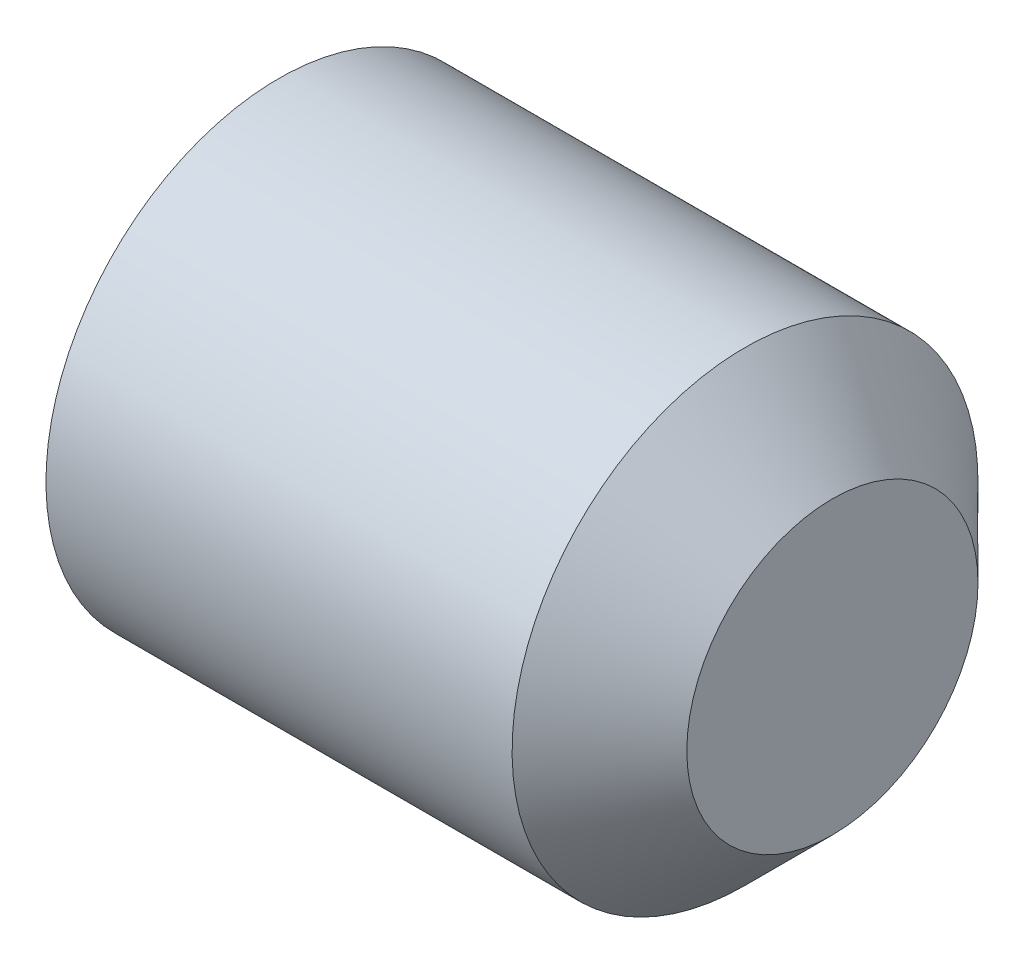
ISO-10303-21;
HEADER;
FILE_DESCRIPTION(('STEP AP214'),'2;1');
FILE_NAME('part.step','',(''),(''),'','','');
FILE_SCHEMA(('AUTOMOTIVE_DESIGN { 1 0 10303 214 1 1 1 1 }'));
ENDSEC;
DATA;
#1=APPLICATION_CONTEXT('core data for automotive mechanical design processes');
#2=APPLICATION_PROTOCOL_DEFINITION('international standard','automotive_design',2000,#1);
#3=PRODUCT_CONTEXT('',#1,'mechanical');
#4=PRODUCT('Part','Part','',(#3));
#5=PRODUCT_RELATED_PRODUCT_CATEGORY('part','',(#4));
#6=PRODUCT_DEFINITION_FORMATION('','',#4);
#7=PRODUCT_DEFINITION_CONTEXT('part definition',#1,'design');
#8=PRODUCT_DEFINITION('design','',#6,#7);
#9=PRODUCT_DEFINITION_SHAPE('','',#8);
#10=(LENGTH_UNIT() NAMED_UNIT(*) SI_UNIT(.MILLI.,.METRE.));
#11=(NAMED_UNIT(*) PLANE_ANGLE_UNIT() SI_UNIT($,.RADIAN.));
#12=(NAMED_UNIT(*) SI_UNIT($,.STERADIAN.) SOLID_ANGLE_UNIT());
#13=UNCERTAINTY_MEASURE_WITH_UNIT(LENGTH_MEASURE(1.E-05),#10,'distance_accuracy_value','');
#14=(GEOMETRIC_REPRESENTATION_CONTEXT(3) GLOBAL_UNCERTAINTY_ASSIGNED_CONTEXT((#13)) GLOBAL_UNIT_ASSIGNED_CONTEXT((#10,
#11,#12)) REPRESENTATION_CONTEXT('',''));
#15=CARTESIAN_POINT('',(0.,0.,0.));
#16=DIRECTION('',(0.,0.,1.));
#17=DIRECTION('',(1.,0.,0.));
#18=AXIS2_PLACEMENT_3D('',#15,#16,#17);
#19=CARTESIAN_POINT('',(0.66666666666667,0.,0.));
#20=DIRECTION('',(-1.,0.,0.));
#21=DIRECTION('',(0.,-1.,0.));
#22=AXIS2_PLACEMENT_3D('',#19,#20,#21);
#23=CONICAL_SURFACE('',#22,0.,1.04719755119661);
#24=CARTESIAN_POINT('',(0.,0.,0.));
#25=DIRECTION('',(-1.,0.,0.));
#26=DIRECTION('',(0.,-1.,0.));
#27=AXIS2_PLACEMENT_3D('',#24,#25,#26);
#28=CIRCLE('',#27,1.1547005383793);
#29=CARTESIAN_POINT('',(0.,0.,1.1547005383793));
#30=VERTEX_POINT('',#29);
#31=CARTESIAN_POINT('',(0.,1.00000000000008,0.577350269189584));
#32=VERTEX_POINT('',#31);
#33=EDGE_CURVE('E133',#30,#32,#28,.T.);
#34=ORIENTED_EDGE('',*,*,#33,.T.);
#35=CARTESIAN_POINT('',(-6.66766656399665E-05,1.0002,0.577234799135792));
#36=CARTESIAN_POINT('',(0.0145910263508786,0.956252680601721,0.602607795820553));
#37=CARTESIAN_POINT('',(0.0279222763791293,0.911926016050181,0.628199807531665));
#38=CARTESIAN_POINT('',(0.0511934923765663,0.822504925328881,0.679827098330841));
#39=CARTESIAN_POINT('',(0.061125223450238,0.777408908798272,0.70586329561417));
#40=CARTESIAN_POINT('',(0.0765873051179378,0.687775829477386,0.757612978088382));
#41=CARTESIAN_POINT('',(0.082220531901062,0.643252567766787,0.783318495222199));
#42=CARTESIAN_POINT('',(0.0889487113597592,0.55399626028499,0.83485064837369));
#43=CARTESIAN_POINT('',(0.0900492320783483,0.509263539518514,0.860677096749802));
#44=CARTESIAN_POINT('',(0.0877749477018723,0.425658889182662,0.908946264126714));
#45=CARTESIAN_POINT('',(0.0849585611365997,0.386774523211241,0.931396163287583));
#46=CARTESIAN_POINT('',(0.0760275497826569,0.30925915501482,0.976149681982124));
#47=CARTESIAN_POINT('',(0.0699098662457069,0.270628421438366,0.998453146411484));
#48=CARTESIAN_POINT('',(0.0546142742741818,0.192952883515859,1.0432991391405));
#49=CARTESIAN_POINT('',(0.0453714478310436,0.153917923728835,1.06583598368134));
#50=CARTESIAN_POINT('',(0.0243931542444719,0.0764306187239893,1.11057330008467));
#51=CARTESIAN_POINT('',(0.012662624866338,0.0379772787061415,1.13277434629522));
#52=CARTESIAN_POINT('',(-6.66766656664409E-05,-0.000200000000000106,1.15481600843314));
#53=B_SPLINE_CURVE_WITH_KNOTS('',3,(#35,#36,#37,#38,#39,#40,#41,#42,#43,#44,#45,#46,#47,#48,#49,
#50,#51,#52),.UNSPECIFIED.,.F.,.F.,(4,2,2,2,2,2,2,2,4),(0.,0.158523820030115,0.317428970089341,
0.472400167924632,0.627180939971646,0.762016584872715,0.896977373984242,1.03493410168669,
1.17261952416174),.UNSPECIFIED.);
#54=EDGE_CURVE('E11',#32,#30,#53,.T.);
#55=ORIENTED_EDGE('',*,*,#54,.T.);
#56=EDGE_LOOP('',(#34,#55));
#57=FACE_BOUND('',#56,.T.);
#58=ADVANCED_FACE('F31',(#57),#23,.F.);
#59=CARTESIAN_POINT('',(0.,-1.,0.57735026918963));
#60=VERTEX_POINT('',#59);
#61=EDGE_CURVE('E129',#60,#30,#28,.T.);
#62=ORIENTED_EDGE('',*,*,#61,.T.);
#63=CARTESIAN_POINT('',(-6.66766656665343E-05,0.000199999999999947,1.15481600843314));
#64=CARTESIAN_POINT('',(0.0145910263508541,-0.0437473193982807,1.12944301174838));
#65=CARTESIAN_POINT('',(0.027922276379107,-0.0880739839498216,1.10385100003726));
#66=CARTESIAN_POINT('',(0.0511934923765487,-0.177495074671124,1.05222370923809));
#67=CARTESIAN_POINT('',(0.0611252234502229,-0.222591091201734,1.02618751195476));
#68=CARTESIAN_POINT('',(0.0765873051179279,-0.312224170522623,0.974437829480542));
#69=CARTESIAN_POINT('',(0.0822205319010547,-0.356747432233225,0.948732312346724));
#70=CARTESIAN_POINT('',(0.0889487113597568,-0.446003739715024,0.897200159195231));
#71=CARTESIAN_POINT('',(0.0900492320783479,-0.490736460481502,0.871373710819119));
#72=CARTESIAN_POINT('',(0.0877749477018759,-0.574341110817354,0.823104543442207));
#73=CARTESIAN_POINT('',(0.0849585611366055,-0.613225476788773,0.800654644281338));
#74=CARTESIAN_POINT('',(0.0760275497826668,-0.690740844985192,0.755901125586799));
#75=CARTESIAN_POINT('',(0.0699098662457189,-0.729371578561644,0.73359766115744));
#76=CARTESIAN_POINT('',(0.054614274274198,-0.807047116484149,0.68875166842843));
#77=CARTESIAN_POINT('',(0.045371447831062,-0.84608207627117,0.666214823887585));
#78=CARTESIAN_POINT('',(0.0243931542444946,-0.923569381276013,0.621477507484257));
#79=CARTESIAN_POINT('',(0.0126626248663627,-0.96202272129386,0.599276461273711));
#80=CARTESIAN_POINT('',(-6.66766656397759E-05,-1.0002,0.577234799135792));
#81=B_SPLINE_CURVE_WITH_KNOTS('',3,(#63,#64,#65,#66,#67,#68,#69,#70,#71,#72,#73,#74,#75,#76,#77,
#78,#79,#80),.UNSPECIFIED.,.F.,.F.,(4,2,2,2,2,2,2,2,4),(0.,0.158523820030121,0.317428970089354,
0.47240016792465,0.627180939971671,0.762016584872733,0.896977373984255,1.03493410168669,
1.17261952416174),.UNSPECIFIED.);
#82=EDGE_CURVE('E44',#30,#60,#81,.T.);
#83=ORIENTED_EDGE('',*,*,#82,.T.);
#84=EDGE_LOOP('',(#62,#83));
#85=FACE_BOUND('',#84,.T.);
#86=ADVANCED_FACE('F199',(#85),#23,.F.);
#87=CARTESIAN_POINT('',(0.,-1.,-0.57735026918963));
#88=VERTEX_POINT('',#87);
#89=EDGE_CURVE('E128',#88,#60,#28,.T.);
#90=ORIENTED_EDGE('',*,*,#89,.T.);
#91=CARTESIAN_POINT('',(-0.371835288739451,-1.,-1.49514512143379));
#92=CARTESIAN_POINT('',(-0.351115020793417,-1.,-1.45196126115335));
#93=CARTESIAN_POINT('',(-0.330613672349449,-1.,-1.40867282404241));
#94=CARTESIAN_POINT('',(-0.290163433524583,-1.,-1.32182947914252));
#95=CARTESIAN_POINT('',(-0.270214642567272,-1.,-1.2782745250976));
#96=CARTESIAN_POINT('',(-0.211145154836465,-1.,-1.14662339890629));
#97=CARTESIAN_POINT('',(-0.173052526533021,-1.,-1.05805724149112));
#98=CARTESIAN_POINT('',(-0.100245820700553,-1.,-0.876833003172523));
#99=CARTESIAN_POINT('',(-0.0656458404538963,-1.,-0.784128452056518));
#100=CARTESIAN_POINT('',(-0.00407347381842811,-1.,-0.596331746532146));
#101=CARTESIAN_POINT('',(0.0229187151521698,-1.,-0.501246505541269));
#102=CARTESIAN_POINT('',(0.0542242299650066,-1.,-0.356699986452712));
#103=CARTESIAN_POINT('',(0.0631249014530373,-1.,-0.308244163171718));
#104=CARTESIAN_POINT('',(0.0772575682431124,-1.,-0.210788870695452));
#105=CARTESIAN_POINT('',(0.0824898114648446,-1.,-0.161789438465751));
#106=CARTESIAN_POINT('',(0.0888010190182573,-1.,-0.0641060489970755));
#107=CARTESIAN_POINT('',(0.0899289949889198,-1.,-0.0154253461269865));
#108=CARTESIAN_POINT('',(0.0880670216948876,-1.,0.0818553564032658));
#109=CARTESIAN_POINT('',(0.0850768174464161,-1.,0.130455350879693));
#110=CARTESIAN_POINT('',(0.0728816782707232,-1.,0.250369589613771));
#111=CARTESIAN_POINT('',(0.0613914390151371,-1.,0.321451919115022));
#112=CARTESIAN_POINT('',(0.0317596826023959,-1.,0.462229038490167));
#113=CARTESIAN_POINT('',(0.0136101490551007,-1.,0.531922048861734));
#114=CARTESIAN_POINT('',(-0.0278697226866181,-1.,0.671415729806811));
#115=CARTESIAN_POINT('',(-0.051307168306903,-1.,0.741183729418078));
#116=CARTESIAN_POINT('',(-0.101564488246382,-1.,0.8794383193963));
#117=CARTESIAN_POINT('',(-0.12838317523044,-1.,0.947925349932574));
#118=CARTESIAN_POINT('',(-0.200053915473368,-1.,1.12214515906646));
#119=CARTESIAN_POINT('',(-0.246572305198955,-1.,1.2271857404068));
#120=CARTESIAN_POINT('',(-0.342876922247949,-1.,1.4357596810456));
#121=CARTESIAN_POINT('',(-0.392663987822206,-1.,1.5392926453335));
#122=CARTESIAN_POINT('',(-0.494336444534604,-1.,1.74546702338824));
#123=CARTESIAN_POINT('',(-0.546224181866939,-1.,1.84810727554001));
#124=CARTESIAN_POINT('',(-0.651338368835187,-1.,2.05270058021729));
#125=CARTESIAN_POINT('',(-0.704564862672294,-1.,2.15465360991175));
#126=CARTESIAN_POINT('',(-0.806866916911162,-1.,2.34846553091286));
#127=CARTESIAN_POINT('',(-0.855859658963996,-1.,2.44036823161574));
#128=CARTESIAN_POINT('',(-0.954403132828168,-1.,2.62387799005304));
#129=CARTESIAN_POINT('',(-1.00395388528944,-1.,2.7154850366839));
#130=CARTESIAN_POINT('',(-1.10334710767978,-1.,2.89823865557597));
#131=CARTESIAN_POINT('',(-1.15318851504097,-1.,2.98938580641159));
#132=CARTESIAN_POINT('',(-1.25319572337608,-1.,3.17149583112626));
#133=CARTESIAN_POINT('',(-1.3033615072371,-1.,3.26245871439939));
#134=CARTESIAN_POINT('',(-1.35364621220491,-1.,3.3533553920818));
#135=B_SPLINE_CURVE_WITH_KNOTS('',3,(#91,#92,#93,#94,#95,#96,#97,#98,#99,#100,#101,#102,#103,
#104,#105,#106,#107,#108,#109,#110,#111,#112,#113,#114,#115,#116,#117,#118,#119,#120,#121,#122,
#123,#124,#125,#126,#127,#128,#129,#130,#131,#132,#133,#134),.UNSPECIFIED.,.F.,.F.,(4,2,2,2,2,2,
2,2,2,2,2,2,2,2,2,2,2,2,2,2,2,4),(0.,0.143690341820654,0.287406372566282,0.576560332877511,
0.873259488934062,1.1691790700001,1.31686338831961,1.46453772487646,1.61044269221663,
1.75635669390456,1.97192533331902,2.18775432802318,2.40842600301171,2.62902040304942,
2.97355048126465,3.3181692618629,3.66318417395138,4.00821049225249,4.32064609598604,
4.63309330006995,4.94474578248769,5.25638195528649),.UNSPECIFIED.);
#136=EDGE_CURVE('E175',#60,#88,#135,.F.);
#137=ORIENTED_EDGE('',*,*,#136,.T.);
#138=EDGE_LOOP('',(#90,#137));
#139=FACE_BOUND('',#138,.T.);
#140=ADVANCED_FACE('F205',(#139),#23,.F.);
#141=CARTESIAN_POINT('',(0.,0.,-1.1547005383793));
#142=VERTEX_POINT('',#141);
#143=EDGE_CURVE('E227',#142,#88,#28,.T.);
#144=ORIENTED_EDGE('',*,*,#143,.T.);
#145=CARTESIAN_POINT('',(-6.66766656396785E-05,-1.0002,-0.577234799135792));
#146=CARTESIAN_POINT('',(0.0145910263508786,-0.956252680601721,-0.602607795820553));
#147=CARTESIAN_POINT('',(0.0279222763791292,-0.911926016050181,-0.628199807531665));
#148=CARTESIAN_POINT('',(0.0511934923765662,-0.822504925328881,-0.679827098330841));
#149=CARTESIAN_POINT('',(0.061125223450238,-0.777408908798272,-0.70586329561417));
#150=CARTESIAN_POINT('',(0.076587305117938,-0.687775829477386,-0.757612978088382));
#151=CARTESIAN_POINT('',(0.0822205319010621,-0.643252567766786,-0.783318495222199));
#152=CARTESIAN_POINT('',(0.0889487113597592,-0.55399626028499,-0.83485064837369));
#153=CARTESIAN_POINT('',(0.0900492320783481,-0.509263539518514,-0.860677096749802));
#154=CARTESIAN_POINT('',(0.0877749477018722,-0.425658889182662,-0.908946264126714));
#155=CARTESIAN_POINT('',(0.0849585611365999,-0.386774523211241,-0.931396163287584));
#156=CARTESIAN_POINT('',(0.0760275497826571,-0.30925915501482,-0.976149681982124));
#157=CARTESIAN_POINT('',(0.0699098662457069,-0.270628421438366,-0.998453146411484));
#158=CARTESIAN_POINT('',(0.0546142742741816,-0.192952883515859,-1.0432991391405));
#159=CARTESIAN_POINT('',(0.0453714478310435,-0.153917923728835,-1.06583598368134));
#160=CARTESIAN_POINT('',(0.0243931542444719,-0.0764306187239892,-1.11057330008467));
#161=CARTESIAN_POINT('',(0.0126626248663381,-0.0379772787061413,-1.13277434629522));
#162=CARTESIAN_POINT('',(-6.66766656664812E-05,0.000200000000000098,-1.15481600843314));
#163=B_SPLINE_CURVE_WITH_KNOTS('',3,(#145,#146,#147,#148,#149,#150,#151,#152,#153,#154,#155,
#156,#157,#158,#159,#160,#161,#162),.UNSPECIFIED.,.F.,.F.,(4,2,2,2,2,2,2,2,4),(0.,
0.158523820030115,0.317428970089342,0.472400167924632,0.627180939971647,0.762016584872715,
0.896977373984243,1.03493410168669,1.17261952416174),.UNSPECIFIED.);
#164=EDGE_CURVE('E170',#88,#142,#163,.T.);
#165=ORIENTED_EDGE('',*,*,#164,.T.);
#166=EDGE_LOOP('',(#144,#165));
#167=FACE_BOUND('',#166,.T.);
#168=ADVANCED_FACE('F217',(#167),#23,.F.);
#169=CARTESIAN_POINT('',(0.,1.,-0.57735026918963));
#170=VERTEX_POINT('',#169);
#171=EDGE_CURVE('E225',#170,#142,#28,.T.);
#172=ORIENTED_EDGE('',*,*,#171,.T.);
#173=CARTESIAN_POINT('',(-6.66766656665343E-05,-0.000199999999999947,-1.15481600843314));
#174=CARTESIAN_POINT('',(0.0145910263508542,0.0437473193982806,-1.12944301174838));
#175=CARTESIAN_POINT('',(0.0279222763791071,0.0880739839498216,-1.10385100003726));
#176=CARTESIAN_POINT('',(0.0511934923765488,0.177495074671125,-1.05222370923809));
#177=CARTESIAN_POINT('',(0.061125223450223,0.222591091201735,-1.02618751195476));
#178=CARTESIAN_POINT('',(0.0765873051179279,0.312224170522623,-0.974437829480542));
#179=CARTESIAN_POINT('',(0.0822205319010546,0.356747432233225,-0.948732312346724));
#180=CARTESIAN_POINT('',(0.0889487113597566,0.446003739715024,-0.897200159195231));
#181=CARTESIAN_POINT('',(0.0900492320783478,0.490736460481502,-0.871373710819119));
#182=CARTESIAN_POINT('',(0.0877749477018758,0.574341110817354,-0.823104543442207));
#183=CARTESIAN_POINT('',(0.0849585611366055,0.613225476788773,-0.800654644281338));
#184=CARTESIAN_POINT('',(0.0760275497826669,0.690740844985192,-0.755901125586799));
#185=CARTESIAN_POINT('',(0.0699098662457189,0.729371578561644,-0.73359766115744));
#186=CARTESIAN_POINT('',(0.054614274274198,0.807047116484148,-0.68875166842843));
#187=CARTESIAN_POINT('',(0.0453714478310621,0.84608207627117,-0.666214823887585));
#188=CARTESIAN_POINT('',(0.0243931542444946,0.923569381276013,-0.621477507484257));
#189=CARTESIAN_POINT('',(0.0126626248663627,0.96202272129386,-0.599276461273711));
#190=CARTESIAN_POINT('',(-6.66766656400063E-05,1.0002,-0.577234799135792));
#191=B_SPLINE_CURVE_WITH_KNOTS('',3,(#173,#174,#175,#176,#177,#178,#179,#180,#181,#182,#183,
#184,#185,#186,#187,#188,#189,#190),.UNSPECIFIED.,.F.,.F.,(4,2,2,2,2,2,2,2,4),(0.,
0.158523820030121,0.317428970089354,0.472400167924651,0.627180939971671,0.762016584872733,
0.896977373984255,1.03493410168669,1.17261952416174),.UNSPECIFIED.);
#192=EDGE_CURVE('E111',#142,#170,#191,.T.);
#193=ORIENTED_EDGE('',*,*,#192,.T.);
#194=EDGE_LOOP('',(#172,#193));
#195=FACE_BOUND('',#194,.T.);
#196=ADVANCED_FACE('F209',(#195),#23,.F.);
#197=EDGE_CURVE('E221',#32,#170,#28,.T.);
#198=ORIENTED_EDGE('',*,*,#197,.T.);
#199=CARTESIAN_POINT('',(-0.371835288739452,1.,-1.49514512143379));
#200=CARTESIAN_POINT('',(-0.351115020793417,1.,-1.45196126115335));
#201=CARTESIAN_POINT('',(-0.33061367234945,1.,-1.40867282404241));
#202=CARTESIAN_POINT('',(-0.290163433524583,1.,-1.32182947914252));
#203=CARTESIAN_POINT('',(-0.270214642567272,1.,-1.2782745250976));
#204=CARTESIAN_POINT('',(-0.211145154836466,1.,-1.14662339890629));
#205=CARTESIAN_POINT('',(-0.173052526533021,1.,-1.05805724149112));
#206=CARTESIAN_POINT('',(-0.100245820700553,1.,-0.876833003172523));
#207=CARTESIAN_POINT('',(-0.0656458404538965,1.,-0.784128452056518));
#208=CARTESIAN_POINT('',(-0.00407347381842816,1.,-0.596331746532146));
#209=CARTESIAN_POINT('',(0.0229187151521698,1.,-0.501246505541268));
#210=CARTESIAN_POINT('',(0.0542242299650066,1.,-0.356699986452711));
#211=CARTESIAN_POINT('',(0.0631249014530372,1.,-0.308244163171718));
#212=CARTESIAN_POINT('',(0.0772575682431122,1.,-0.210788870695451));
#213=CARTESIAN_POINT('',(0.0824898114648444,1.,-0.161789438465751));
#214=CARTESIAN_POINT('',(0.0888010190182571,1.,-0.0641060489970751));
#215=CARTESIAN_POINT('',(0.0899289949889195,1.,-0.0154253461269861));
#216=CARTESIAN_POINT('',(0.0880670216948874,1.,0.0818553564032661));
#217=CARTESIAN_POINT('',(0.0850768174464159,1.,0.130455350879693));
#218=CARTESIAN_POINT('',(0.0728816782707231,1.,0.250369589613771));
#219=CARTESIAN_POINT('',(0.0613914390151369,1.,0.321451919115022));
#220=CARTESIAN_POINT('',(0.0317596826023956,1.,0.462229038490166));
#221=CARTESIAN_POINT('',(0.0136101490551005,1.,0.531922048861734));
#222=CARTESIAN_POINT('',(-0.0278697226866183,1.,0.671415729806811));
#223=CARTESIAN_POINT('',(-0.0513071683069032,1.,0.741183729418078));
#224=CARTESIAN_POINT('',(-0.101564488246382,1.,0.8794383193963));
#225=CARTESIAN_POINT('',(-0.12838317523044,1.,0.947925349932574));
#226=CARTESIAN_POINT('',(-0.200053915473368,1.,1.12214515906646));
#227=CARTESIAN_POINT('',(-0.246572305198956,1.,1.2271857404068));
#228=CARTESIAN_POINT('',(-0.34287692224795,1.,1.4357596810456));
#229=CARTESIAN_POINT('',(-0.392663987822206,1.,1.5392926453335));
#230=CARTESIAN_POINT('',(-0.494336444534604,1.,1.74546702338824));
#231=CARTESIAN_POINT('',(-0.546224181866939,1.,1.84810727554001));
#232=CARTESIAN_POINT('',(-0.651338368835186,1.,2.05270058021729));
#233=CARTESIAN_POINT('',(-0.704564862672293,1.,2.15465360991175));
#234=CARTESIAN_POINT('',(-0.806866916911162,1.,2.34846553091286));
#235=CARTESIAN_POINT('',(-0.855859658963996,1.,2.44036823161574));
#236=CARTESIAN_POINT('',(-0.954403132828169,1.,2.62387799005304));
#237=CARTESIAN_POINT('',(-1.00395388528944,1.,2.7154850366839));
#238=CARTESIAN_POINT('',(-1.10334710767978,1.,2.89823865557597));
#239=CARTESIAN_POINT('',(-1.15318851504097,1.,2.98938580641159));
#240=CARTESIAN_POINT('',(-1.25319572337608,1.,3.17149583112626));
#241=CARTESIAN_POINT('',(-1.3033615072371,1.,3.26245871439939));
#242=CARTESIAN_POINT('',(-1.35364621220492,1.,3.3533553920818));
#243=B_SPLINE_CURVE_WITH_KNOTS('',3,(#199,#200,#201,#202,#203,#204,#205,#206,#207,#208,#209,
#210,#211,#212,#213,#214,#215,#216,#217,#218,#219,#220,#221,#222,#223,#224,#225,#226,#227,#228,
#229,#230,#231,#232,#233,#234,#235,#236,#237,#238,#239,#240,#241,#242),.UNSPECIFIED.,.F.,.F.,(4,
2,2,2,2,2,2,2,2,2,2,2,2,2,2,2,2,2,2,2,2,4),(0.,0.143690341820654,0.287406372566282,
0.576560332877512,0.873259488934062,1.1691790700001,1.31686338831961,1.46453772487646,
1.61044269221663,1.75635669390456,1.97192533331902,2.18775432802318,2.40842600301171,
2.62902040304942,2.97355048126465,3.3181692618629,3.66318417395138,4.00821049225249,
4.32064609598604,4.63309330006995,4.94474578248769,5.25638195528649),.UNSPECIFIED.);
#244=EDGE_CURVE('E77',#170,#32,#243,.T.);
#245=ORIENTED_EDGE('',*,*,#244,.T.);
#246=EDGE_LOOP('',(#198,#245));
#247=FACE_BOUND('',#246,.T.);
#248=ADVANCED_FACE('F201',(#247),#23,.F.);
#249=CARTESIAN_POINT('',(5.,0.,0.));
#250=DIRECTION('',(1.,0.,0.));
#251=DIRECTION('',(0.,1.,0.));
#252=AXIS2_PLACEMENT_3D('',#249,#250,#251);
#253=PLANE('',#252);
#254=CARTESIAN_POINT('',(5.,0.,0.));
#255=DIRECTION('',(-1.,0.,0.));
#256=DIRECTION('',(0.,-1.,0.));
#257=AXIS2_PLACEMENT_3D('',#254,#255,#256);
#258=CIRCLE('',#257,1.25);
#259=CARTESIAN_POINT('',(5.,-1.25,0.));
#260=VERTEX_POINT('',#259);
#261=EDGE_CURVE('E142',#260,#260,#258,.T.);
#262=ORIENTED_EDGE('',*,*,#261,.F.);
#263=EDGE_LOOP('',(#262));
#264=FACE_BOUND('',#263,.T.);
#265=ADVANCED_FACE('F33',(#264),#253,.T.);
#266=CARTESIAN_POINT('',(4.25,0.,0.));
#267=DIRECTION('',(-1.,0.,0.));
#268=DIRECTION('',(0.,-1.,0.));
#269=AXIS2_PLACEMENT_3D('',#266,#267,#268);
#270=CONICAL_SURFACE('',#269,2.,0.785398163397449);
#271=ORIENTED_EDGE('',*,*,#261,.T.);
#272=EDGE_LOOP('',(#271));
#273=FACE_BOUND('',#272,.T.);
#274=CARTESIAN_POINT('',(4.25,0.,0.));
#275=DIRECTION('',(-1.,0.,0.));
#276=DIRECTION('',(0.,-1.,0.));
#277=AXIS2_PLACEMENT_3D('',#274,#275,#276);
#278=CIRCLE('',#277,2.);
#279=CARTESIAN_POINT('',(4.25,-2.,0.));
#280=VERTEX_POINT('',#279);
#281=EDGE_CURVE('E139',#280,#280,#278,.T.);
#282=ORIENTED_EDGE('',*,*,#281,.F.);
#283=EDGE_LOOP('',(#282));
#284=FACE_BOUND('',#283,.T.);
#285=ADVANCED_FACE('F215',(#273,#284),#270,.T.);
#286=CARTESIAN_POINT('',(0.66666666666667,0.,0.));
#287=DIRECTION('',(-1.,0.,0.));
#288=DIRECTION('',(0.,-1.,0.));
#289=AXIS2_PLACEMENT_3D('',#286,#287,#288);
#290=CYLINDRICAL_SURFACE('',#289,2.);
#291=ORIENTED_EDGE('',*,*,#281,.T.);
#292=EDGE_LOOP('',(#291));
#293=FACE_BOUND('',#292,.T.);
#294=CARTESIAN_POINT('',(0.24797194061694,0.,0.));
#295=DIRECTION('',(-1.,0.,0.));
#296=DIRECTION('',(0.,-1.,0.));
#297=AXIS2_PLACEMENT_3D('',#294,#295,#296);
#298=CIRCLE('',#297,2.);
#299=CARTESIAN_POINT('',(0.24797194061694,-2.,0.));
#300=VERTEX_POINT('',#299);
#301=EDGE_CURVE('E136',#300,#300,#298,.T.);
#302=ORIENTED_EDGE('',*,*,#301,.F.);
#303=EDGE_LOOP('',(#302));
#304=FACE_BOUND('',#303,.T.);
#305=ADVANCED_FACE('F324',(#293,#304),#290,.T.);
#306=CARTESIAN_POINT('',(0.,0.,0.));
#307=DIRECTION('',(1.,0.,0.));
#308=DIRECTION('',(0.,1.,0.));
#309=AXIS2_PLACEMENT_3D('',#306,#307,#308);
#310=CONICAL_SURFACE('',#309,1.5705,1.04719755119661);
#311=ORIENTED_EDGE('',*,*,#301,.T.);
#312=EDGE_LOOP('',(#311));
#313=FACE_BOUND('',#312,.T.);
#314=CARTESIAN_POINT('',(0.,0.,0.));
#315=DIRECTION('',(-1.,0.,0.));
#316=DIRECTION('',(0.,-1.,0.));
#317=AXIS2_PLACEMENT_3D('',#314,#315,#316);
#318=CIRCLE('',#317,1.5705);
#319=CARTESIAN_POINT('',(0.,-1.5705,0.));
#320=VERTEX_POINT('',#319);
#321=EDGE_CURVE('E132',#320,#320,#318,.T.);
#322=ORIENTED_EDGE('',*,*,#321,.F.);
#323=EDGE_LOOP('',(#322));
#324=FACE_BOUND('',#323,.T.);
#325=ADVANCED_FACE('F196',(#313,#324),#310,.T.);
#326=CARTESIAN_POINT('',(0.,-1.5705,0.));
#327=DIRECTION('',(-1.,0.,0.));
#328=DIRECTION('',(0.,-1.,0.));
#329=AXIS2_PLACEMENT_3D('',#326,#327,#328);
#330=PLANE('',#329);
#331=ORIENTED_EDGE('',*,*,#321,.T.);
#332=EDGE_LOOP('',(#331));
#333=FACE_BOUND('',#332,.T.);
#334=ORIENTED_EDGE('',*,*,#61,.F.);
#335=ORIENTED_EDGE('',*,*,#89,.F.);
#336=ORIENTED_EDGE('',*,*,#143,.F.);
#337=ORIENTED_EDGE('',*,*,#171,.F.);
#338=ORIENTED_EDGE('',*,*,#197,.F.);
#339=ORIENTED_EDGE('',*,*,#33,.F.);
#340=EDGE_LOOP('',(#334,#335,#336,#337,#338,#339));
#341=FACE_BOUND('',#340,.T.);
#342=ADVANCED_FACE('F191',(#333,#341),#330,.T.);
#343=CARTESIAN_POINT('',(1.5,1.,0.57735026918963));
#344=DIRECTION('',(0.,-0.500000000000029,-0.866025403784422));
#345=DIRECTION('',(0.,0.866025403784422,-0.500000000000029));
#346=AXIS2_PLACEMENT_3D('',#343,#344,#345);
#347=PLANE('',#346);
#348=DIRECTION('',(-1.,0.,0.));
#349=VECTOR('',#348,1.);
#350=CARTESIAN_POINT('',(1.5,1.,0.57735026918963));
#351=LINE('',#350,#349);
#352=CARTESIAN_POINT('',(1.5,1.,0.57735026918963));
#353=VERTEX_POINT('',#352);
#354=EDGE_CURVE('E51',#353,#32,#351,.T.);
#355=ORIENTED_EDGE('',*,*,#354,.F.);
#356=DIRECTION('',(0.,-0.866025403784422,0.500000000000029));
#357=VECTOR('',#356,1.);
#358=CARTESIAN_POINT('',(1.5,1.,0.57735026918963));
#359=LINE('',#358,#357);
#360=CARTESIAN_POINT('',(1.5,0.,1.1547005383793));
#361=VERTEX_POINT('',#360);
#362=EDGE_CURVE('E237',#353,#361,#359,.T.);
#363=ORIENTED_EDGE('',*,*,#362,.T.);
#364=DIRECTION('',(-1.,0.,0.));
#365=VECTOR('',#364,1.);
#366=CARTESIAN_POINT('',(1.5,0.,1.1547005383793));
#367=LINE('',#366,#365);
#368=EDGE_CURVE('E125',#361,#30,#367,.T.);
#369=ORIENTED_EDGE('',*,*,#368,.T.);
#370=ORIENTED_EDGE('',*,*,#54,.F.);
#371=EDGE_LOOP('',(#355,#363,#369,#370));
#372=FACE_BOUND('',#371,.T.);
#373=ADVANCED_FACE('F187',(#372),#347,.T.);
#374=CARTESIAN_POINT('',(1.5,0.,1.1547005383793));
#375=DIRECTION('',(0.,0.500000000000029,-0.866025403784422));
#376=DIRECTION('',(0.,0.866025403784422,0.500000000000029));
#377=AXIS2_PLACEMENT_3D('',#374,#375,#376);
#378=PLANE('',#377);
#379=ORIENTED_EDGE('',*,*,#368,.F.);
#380=DIRECTION('',(0.,-0.866025403784422,-0.500000000000029));
#381=VECTOR('',#380,1.);
#382=CARTESIAN_POINT('',(1.5,0.,1.1547005383793));
#383=LINE('',#382,#381);
#384=CARTESIAN_POINT('',(1.5,-1.,0.57735026918963));
#385=VERTEX_POINT('',#384);
#386=EDGE_CURVE('E86',#361,#385,#383,.T.);
#387=ORIENTED_EDGE('',*,*,#386,.T.);
#388=DIRECTION('',(-1.,0.,0.));
#389=VECTOR('',#388,1.);
#390=CARTESIAN_POINT('',(1.5,-1.,0.57735026918963));
#391=LINE('',#390,#389);
#392=EDGE_CURVE('E122',#385,#60,#391,.T.);
#393=ORIENTED_EDGE('',*,*,#392,.T.);
#394=ORIENTED_EDGE('',*,*,#82,.F.);
#395=EDGE_LOOP('',(#379,#387,#393,#394));
#396=FACE_BOUND('',#395,.T.);
#397=ADVANCED_FACE('F184',(#396),#378,.T.);
#398=CARTESIAN_POINT('',(1.5,-1.,0.57735026918963));
#399=DIRECTION('',(0.,1.,0.));
#400=DIRECTION('',(0.,0.,1.));
#401=AXIS2_PLACEMENT_3D('',#398,#399,#400);
#402=PLANE('',#401);
#403=ORIENTED_EDGE('',*,*,#392,.F.);
#404=DIRECTION('',(0.,0.,-1.));
#405=VECTOR('',#404,1.);
#406=CARTESIAN_POINT('',(1.5,-1.,0.57735026918963));
#407=LINE('',#406,#405);
#408=CARTESIAN_POINT('',(1.5,-1.,-0.57735026918963));
#409=VERTEX_POINT('',#408);
#410=EDGE_CURVE('E106',#385,#409,#407,.T.);
#411=ORIENTED_EDGE('',*,*,#410,.T.);
#412=DIRECTION('',(-1.,0.,0.));
#413=VECTOR('',#412,1.);
#414=CARTESIAN_POINT('',(1.5,-1.,-0.57735026918963));
#415=LINE('',#414,#413);
#416=EDGE_CURVE('E103',#409,#88,#415,.T.);
#417=ORIENTED_EDGE('',*,*,#416,.T.);
#418=ORIENTED_EDGE('',*,*,#136,.F.);
#419=EDGE_LOOP('',(#403,#411,#417,#418));
#420=FACE_BOUND('',#419,.T.);
#421=ADVANCED_FACE('F167',(#420),#402,.T.);
#422=CARTESIAN_POINT('',(1.5,-1.,-0.57735026918963));
#423=DIRECTION('',(0.,0.500000000000029,0.866025403784422));
#424=DIRECTION('',(0.,-0.866025403784422,0.500000000000029));
#425=AXIS2_PLACEMENT_3D('',#422,#423,#424);
#426=PLANE('',#425);
#427=ORIENTED_EDGE('',*,*,#416,.F.);
#428=DIRECTION('',(0.,0.866025403784422,-0.500000000000029));
#429=VECTOR('',#428,1.);
#430=CARTESIAN_POINT('',(1.5,-1.,-0.57735026918963));
#431=LINE('',#430,#429);
#432=CARTESIAN_POINT('',(1.5,0.,-1.1547005383793));
#433=VERTEX_POINT('',#432);
#434=EDGE_CURVE('E97',#409,#433,#431,.T.);
#435=ORIENTED_EDGE('',*,*,#434,.T.);
#436=DIRECTION('',(-1.,0.,0.));
#437=VECTOR('',#436,1.);
#438=CARTESIAN_POINT('',(1.5,0.,-1.1547005383793));
#439=LINE('',#438,#437);
#440=EDGE_CURVE('E100',#433,#142,#439,.T.);
#441=ORIENTED_EDGE('',*,*,#440,.T.);
#442=ORIENTED_EDGE('',*,*,#164,.F.);
#443=EDGE_LOOP('',(#427,#435,#441,#442));
#444=FACE_BOUND('',#443,.T.);
#445=ADVANCED_FACE('F99',(#444),#426,.T.);
#446=CARTESIAN_POINT('',(1.5,0.,-1.1547005383793));
#447=DIRECTION('',(0.,-0.500000000000029,0.866025403784422));
#448=DIRECTION('',(0.,-0.866025403784422,-0.500000000000029));
#449=AXIS2_PLACEMENT_3D('',#446,#447,#448);
#450=PLANE('',#449);
#451=ORIENTED_EDGE('',*,*,#440,.F.);
#452=DIRECTION('',(0.,0.866025403784422,0.500000000000029));
#453=VECTOR('',#452,1.);
#454=CARTESIAN_POINT('',(1.5,0.,-1.1547005383793));
#455=LINE('',#454,#453);
#456=CARTESIAN_POINT('',(1.5,1.,-0.57735026918963));
#457=VERTEX_POINT('',#456);
#458=EDGE_CURVE('E105',#433,#457,#455,.T.);
#459=ORIENTED_EDGE('',*,*,#458,.T.);
#460=DIRECTION('',(-1.,0.,0.));
#461=VECTOR('',#460,1.);
#462=CARTESIAN_POINT('',(1.5,1.,-0.57735026918963));
#463=LINE('',#462,#461);
#464=EDGE_CURVE('E112',#457,#170,#463,.T.);
#465=ORIENTED_EDGE('',*,*,#464,.T.);
#466=ORIENTED_EDGE('',*,*,#192,.F.);
#467=EDGE_LOOP('',(#451,#459,#465,#466));
#468=FACE_BOUND('',#467,.T.);
#469=ADVANCED_FACE('F109',(#468),#450,.T.);
#470=CARTESIAN_POINT('',(1.5,1.,-0.57735026918963));
#471=DIRECTION('',(0.,-1.,0.));
#472=DIRECTION('',(0.,0.,-1.));
#473=AXIS2_PLACEMENT_3D('',#470,#471,#472);
#474=PLANE('',#473);
#475=ORIENTED_EDGE('',*,*,#464,.F.);
#476=DIRECTION('',(0.,0.,1.));
#477=VECTOR('',#476,1.);
#478=CARTESIAN_POINT('',(1.5,1.,-0.57735026918963));
#479=LINE('',#478,#477);
#480=EDGE_CURVE('E57',#457,#353,#479,.T.);
#481=ORIENTED_EDGE('',*,*,#480,.T.);
#482=ORIENTED_EDGE('',*,*,#354,.T.);
#483=ORIENTED_EDGE('',*,*,#244,.F.);
#484=EDGE_LOOP('',(#475,#481,#482,#483));
#485=FACE_BOUND('',#484,.T.);
#486=ADVANCED_FACE('F157',(#485),#474,.T.);
#487=CARTESIAN_POINT('',(1.5,0.,1.1547005383793));
#488=DIRECTION('',(1.,0.,0.));
#489=DIRECTION('',(0.,0.,-1.));
#490=AXIS2_PLACEMENT_3D('',#487,#488,#489);
#491=PLANE('',#490);
#492=ORIENTED_EDGE('',*,*,#362,.F.);
#493=ORIENTED_EDGE('',*,*,#480,.F.);
#494=ORIENTED_EDGE('',*,*,#458,.F.);
#495=ORIENTED_EDGE('',*,*,#434,.F.);
#496=ORIENTED_EDGE('',*,*,#410,.F.);
#497=ORIENTED_EDGE('',*,*,#386,.F.);
#498=EDGE_LOOP('',(#492,#493,#494,#495,#496,#497));
#499=FACE_BOUND('',#498,.T.);
#500=ADVANCED_FACE('F114',(#499),#491,.F.);
#501=CLOSED_SHELL('',(#58,#86,#140,#168,#196,#248,#265,#285,#305,#325,#342,#373,#397,#421,#445,
#469,#486,#500));
#502=MANIFOLD_SOLID_BREP('B2',#501);
#503=ADVANCED_BREP_SHAPE_REPRESENTATION('',(#18,#502),#14);
#504=SHAPE_DEFINITION_REPRESENTATION(#9,#503);
ENDSEC;
END-ISO-10303-21;
